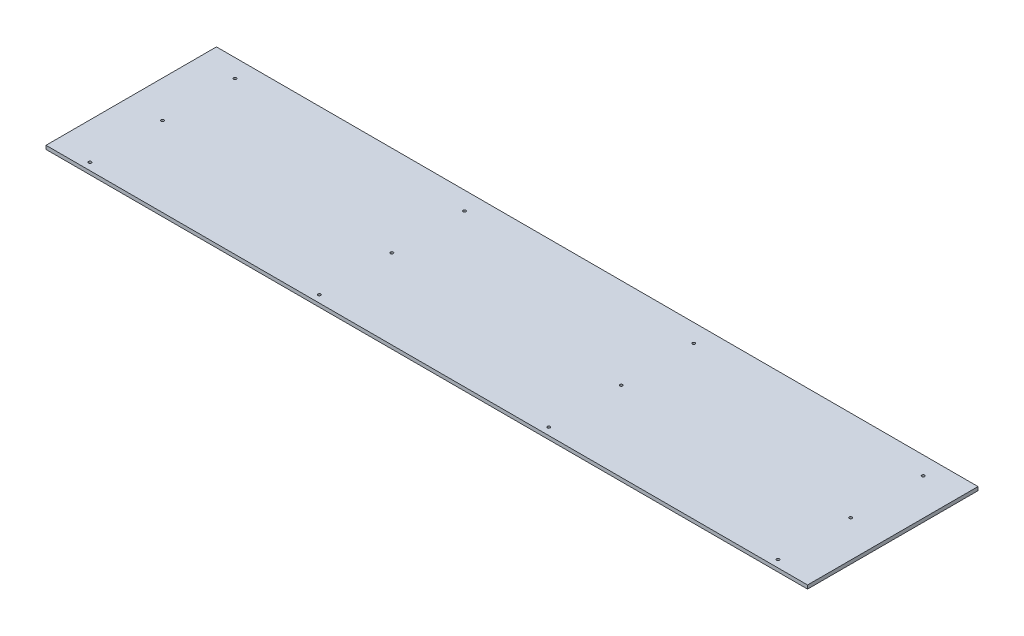
ISO-10303-21;
HEADER;
FILE_DESCRIPTION(('STEP AP214'),'2;1');
FILE_NAME('part.step','',(''),(''),'','','');
FILE_SCHEMA(('AUTOMOTIVE_DESIGN { 1 0 10303 214 1 1 1 1 }'));
ENDSEC;
DATA;
#1=APPLICATION_CONTEXT('core data for automotive mechanical design processes');
#2=APPLICATION_PROTOCOL_DEFINITION('international standard','automotive_design',2000,#1);
#3=PRODUCT_CONTEXT('',#1,'mechanical');
#4=PRODUCT('Part','Part','',(#3));
#5=PRODUCT_RELATED_PRODUCT_CATEGORY('part','',(#4));
#6=PRODUCT_DEFINITION_FORMATION('','',#4);
#7=PRODUCT_DEFINITION_CONTEXT('part definition',#1,'design');
#8=PRODUCT_DEFINITION('design','',#6,#7);
#9=PRODUCT_DEFINITION_SHAPE('','',#8);
#10=(LENGTH_UNIT() NAMED_UNIT(*) SI_UNIT(.MILLI.,.METRE.));
#11=(NAMED_UNIT(*) PLANE_ANGLE_UNIT() SI_UNIT($,.RADIAN.));
#12=(NAMED_UNIT(*) SI_UNIT($,.STERADIAN.) SOLID_ANGLE_UNIT());
#13=UNCERTAINTY_MEASURE_WITH_UNIT(LENGTH_MEASURE(1.E-05),#10,'distance_accuracy_value','');
#14=(GEOMETRIC_REPRESENTATION_CONTEXT(3) GLOBAL_UNCERTAINTY_ASSIGNED_CONTEXT((#13)) GLOBAL_UNIT_ASSIGNED_CONTEXT((#10,
#11,#12)) REPRESENTATION_CONTEXT('',''));
#15=CARTESIAN_POINT('',(0.,0.,0.));
#16=DIRECTION('',(0.,0.,1.));
#17=DIRECTION('',(1.,0.,0.));
#18=AXIS2_PLACEMENT_3D('',#15,#16,#17);
#19=CARTESIAN_POINT('',(0.,6.35,0.));
#20=DIRECTION('',(0.,1.,0.));
#21=DIRECTION('',(0.,0.,1.));
#22=AXIS2_PLACEMENT_3D('',#19,#20,#21);
#23=PLANE('',#22);
#24=CARTESIAN_POINT('',(602.45625,6.35,-120.65));
#25=DIRECTION('',(0.,-1.,0.));
#26=DIRECTION('',(0.,0.,-1.));
#27=AXIS2_PLACEMENT_3D('',#24,#25,#26);
#28=CIRCLE('',#27,2.4384);
#29=CARTESIAN_POINT('',(602.45625,6.35,-123.0884));
#30=VERTEX_POINT('',#29);
#31=EDGE_CURVE('E116',#30,#30,#28,.T.);
#32=ORIENTED_EDGE('',*,*,#31,.T.);
#33=EDGE_LOOP('',(#32));
#34=FACE_BOUND('',#33,.T.);
#35=CARTESIAN_POINT('',(602.45625,6.35,6.35));
#36=DIRECTION('',(0.,-1.,0.));
#37=DIRECTION('',(0.,0.,-1.));
#38=AXIS2_PLACEMENT_3D('',#35,#36,#37);
#39=CIRCLE('',#38,2.4384);
#40=CARTESIAN_POINT('',(602.45625,6.35,3.9116));
#41=VERTEX_POINT('',#40);
#42=EDGE_CURVE('E119',#41,#41,#39,.T.);
#43=ORIENTED_EDGE('',*,*,#42,.T.);
#44=EDGE_LOOP('',(#43));
#45=FACE_BOUND('',#44,.T.);
#46=CARTESIAN_POINT('',(602.45625,6.35,133.35));
#47=DIRECTION('',(0.,-1.,0.));
#48=DIRECTION('',(0.,0.,-1.));
#49=AXIS2_PLACEMENT_3D('',#46,#47,#48);
#50=CIRCLE('',#49,2.4384);
#51=CARTESIAN_POINT('',(602.45625,6.35,130.9116));
#52=VERTEX_POINT('',#51);
#53=EDGE_CURVE('E122',#52,#52,#50,.T.);
#54=ORIENTED_EDGE('',*,*,#53,.T.);
#55=EDGE_LOOP('',(#54));
#56=FACE_BOUND('',#55,.T.);
#57=CARTESIAN_POINT('',(200.81875,6.35,-120.65));
#58=DIRECTION('',(0.,-1.,0.));
#59=DIRECTION('',(0.,0.,-1.));
#60=AXIS2_PLACEMENT_3D('',#57,#58,#59);
#61=CIRCLE('',#60,2.4384);
#62=CARTESIAN_POINT('',(200.81875,6.35,-123.0884));
#63=VERTEX_POINT('',#62);
#64=EDGE_CURVE('E125',#63,#63,#61,.T.);
#65=ORIENTED_EDGE('',*,*,#64,.T.);
#66=EDGE_LOOP('',(#65));
#67=FACE_BOUND('',#66,.T.);
#68=CARTESIAN_POINT('',(200.81875,6.35,6.35));
#69=DIRECTION('',(0.,-1.,0.));
#70=DIRECTION('',(0.,0.,-1.));
#71=AXIS2_PLACEMENT_3D('',#68,#69,#70);
#72=CIRCLE('',#71,2.4384);
#73=CARTESIAN_POINT('',(200.81875,6.35,3.9116));
#74=VERTEX_POINT('',#73);
#75=EDGE_CURVE('E128',#74,#74,#72,.T.);
#76=ORIENTED_EDGE('',*,*,#75,.T.);
#77=EDGE_LOOP('',(#76));
#78=FACE_BOUND('',#77,.T.);
#79=CARTESIAN_POINT('',(200.81875,6.35,133.35));
#80=DIRECTION('',(0.,-1.,0.));
#81=DIRECTION('',(0.,0.,-1.));
#82=AXIS2_PLACEMENT_3D('',#79,#80,#81);
#83=CIRCLE('',#82,2.4384);
#84=CARTESIAN_POINT('',(200.81875,6.35,130.9116));
#85=VERTEX_POINT('',#84);
#86=EDGE_CURVE('E131',#85,#85,#83,.T.);
#87=ORIENTED_EDGE('',*,*,#86,.T.);
#88=EDGE_LOOP('',(#87));
#89=FACE_BOUND('',#88,.T.);
#90=CARTESIAN_POINT('',(-200.81875,6.35,-120.65));
#91=DIRECTION('',(0.,-1.,0.));
#92=DIRECTION('',(0.,0.,-1.));
#93=AXIS2_PLACEMENT_3D('',#90,#91,#92);
#94=CIRCLE('',#93,2.4384);
#95=CARTESIAN_POINT('',(-200.81875,6.35,-123.0884));
#96=VERTEX_POINT('',#95);
#97=EDGE_CURVE('E134',#96,#96,#94,.T.);
#98=ORIENTED_EDGE('',*,*,#97,.T.);
#99=EDGE_LOOP('',(#98));
#100=FACE_BOUND('',#99,.T.);
#101=CARTESIAN_POINT('',(-200.81875,6.35,6.35));
#102=DIRECTION('',(0.,-1.,0.));
#103=DIRECTION('',(0.,0.,-1.));
#104=AXIS2_PLACEMENT_3D('',#101,#102,#103);
#105=CIRCLE('',#104,2.4384);
#106=CARTESIAN_POINT('',(-200.81875,6.35,3.9116));
#107=VERTEX_POINT('',#106);
#108=EDGE_CURVE('E137',#107,#107,#105,.T.);
#109=ORIENTED_EDGE('',*,*,#108,.T.);
#110=EDGE_LOOP('',(#109));
#111=FACE_BOUND('',#110,.T.);
#112=CARTESIAN_POINT('',(-200.81875,6.35,133.35));
#113=DIRECTION('',(0.,-1.,0.));
#114=DIRECTION('',(0.,0.,-1.));
#115=AXIS2_PLACEMENT_3D('',#112,#113,#114);
#116=CIRCLE('',#115,2.4384);
#117=CARTESIAN_POINT('',(-200.81875,6.35,130.9116));
#118=VERTEX_POINT('',#117);
#119=EDGE_CURVE('E140',#118,#118,#116,.T.);
#120=ORIENTED_EDGE('',*,*,#119,.T.);
#121=EDGE_LOOP('',(#120));
#122=FACE_BOUND('',#121,.T.);
#123=CARTESIAN_POINT('',(-602.45625,6.35,-120.65));
#124=DIRECTION('',(0.,-1.,0.));
#125=DIRECTION('',(0.,0.,-1.));
#126=AXIS2_PLACEMENT_3D('',#123,#124,#125);
#127=CIRCLE('',#126,2.4384);
#128=CARTESIAN_POINT('',(-602.45625,6.35,-123.0884));
#129=VERTEX_POINT('',#128);
#130=EDGE_CURVE('E143',#129,#129,#127,.T.);
#131=ORIENTED_EDGE('',*,*,#130,.T.);
#132=EDGE_LOOP('',(#131));
#133=FACE_BOUND('',#132,.T.);
#134=CARTESIAN_POINT('',(-602.45625,6.35,6.35));
#135=DIRECTION('',(0.,-1.,0.));
#136=DIRECTION('',(0.,0.,-1.));
#137=AXIS2_PLACEMENT_3D('',#134,#135,#136);
#138=CIRCLE('',#137,2.4384);
#139=CARTESIAN_POINT('',(-602.45625,6.35,3.9116));
#140=VERTEX_POINT('',#139);
#141=EDGE_CURVE('E145',#140,#140,#138,.T.);
#142=ORIENTED_EDGE('',*,*,#141,.T.);
#143=EDGE_LOOP('',(#142));
#144=FACE_BOUND('',#143,.T.);
#145=CARTESIAN_POINT('',(-602.45625,6.35,133.35));
#146=DIRECTION('',(0.,-1.,0.));
#147=DIRECTION('',(0.,0.,-1.));
#148=AXIS2_PLACEMENT_3D('',#145,#146,#147);
#149=CIRCLE('',#148,2.4384);
#150=CARTESIAN_POINT('',(-602.45625,6.35,130.9116));
#151=VERTEX_POINT('',#150);
#152=EDGE_CURVE('E20',#151,#151,#149,.T.);
#153=ORIENTED_EDGE('',*,*,#152,.T.);
#154=EDGE_LOOP('',(#153));
#155=FACE_BOUND('',#154,.T.);
#156=DIRECTION('',(-1.,0.,0.));
#157=VECTOR('',#156,1.);
#158=CARTESIAN_POINT('',(666.75,6.35,-152.4));
#159=LINE('',#158,#157);
#160=CARTESIAN_POINT('',(-666.75,6.35,-152.4));
#161=VERTEX_POINT('',#160);
#162=CARTESIAN_POINT('',(666.75,6.35,-152.4));
#163=VERTEX_POINT('',#162);
#164=EDGE_CURVE('E71',#161,#163,#159,.F.);
#165=ORIENTED_EDGE('',*,*,#164,.F.);
#166=DIRECTION('',(0.,0.,1.));
#167=VECTOR('',#166,1.);
#168=CARTESIAN_POINT('',(-666.75,6.35,-152.4));
#169=LINE('',#168,#167);
#170=CARTESIAN_POINT('',(-666.75,6.35,146.05));
#171=VERTEX_POINT('',#170);
#172=EDGE_CURVE('E68',#171,#161,#169,.F.);
#173=ORIENTED_EDGE('',*,*,#172,.F.);
#174=DIRECTION('',(1.,0.,0.));
#175=VECTOR('',#174,1.);
#176=CARTESIAN_POINT('',(-666.75,6.35,146.05));
#177=LINE('',#176,#175);
#178=CARTESIAN_POINT('',(666.75,6.35,146.05));
#179=VERTEX_POINT('',#178);
#180=EDGE_CURVE('E59',#179,#171,#177,.F.);
#181=ORIENTED_EDGE('',*,*,#180,.F.);
#182=DIRECTION('',(0.,0.,-1.));
#183=VECTOR('',#182,1.);
#184=CARTESIAN_POINT('',(666.75,6.35,146.05));
#185=LINE('',#184,#183);
#186=EDGE_CURVE('E54',#163,#179,#185,.F.);
#187=ORIENTED_EDGE('',*,*,#186,.F.);
#188=EDGE_LOOP('',(#165,#173,#181,#187));
#189=FACE_BOUND('',#188,.T.);
#190=ADVANCED_FACE('F17',(#34,#45,#56,#67,#78,#89,#100,#111,#122,#133,#144,#155,#189),#23,.T.);
#191=CARTESIAN_POINT('',(-666.75,0.,-152.4));
#192=DIRECTION('',(-1.,0.,0.));
#193=DIRECTION('',(0.,0.,1.));
#194=AXIS2_PLACEMENT_3D('',#191,#192,#193);
#195=PLANE('',#194);
#196=DIRECTION('',(0.,1.,0.));
#197=VECTOR('',#196,1.);
#198=CARTESIAN_POINT('',(-666.75,0.,-152.4));
#199=LINE('',#198,#197);
#200=CARTESIAN_POINT('',(-666.75,0.,-152.4));
#201=VERTEX_POINT('',#200);
#202=EDGE_CURVE('E153',#201,#161,#199,.T.);
#203=ORIENTED_EDGE('',*,*,#202,.F.);
#204=DIRECTION('',(0.,0.,1.));
#205=VECTOR('',#204,1.);
#206=CARTESIAN_POINT('',(-666.75,0.,0.));
#207=LINE('',#206,#205);
#208=CARTESIAN_POINT('',(-666.75,0.,146.05));
#209=VERTEX_POINT('',#208);
#210=EDGE_CURVE('E78',#201,#209,#207,.T.);
#211=ORIENTED_EDGE('',*,*,#210,.T.);
#212=DIRECTION('',(0.,1.,0.));
#213=VECTOR('',#212,1.);
#214=CARTESIAN_POINT('',(-666.75,0.,146.05));
#215=LINE('',#214,#213);
#216=EDGE_CURVE('E64',#171,#209,#215,.F.);
#217=ORIENTED_EDGE('',*,*,#216,.F.);
#218=ORIENTED_EDGE('',*,*,#172,.T.);
#219=EDGE_LOOP('',(#203,#211,#217,#218));
#220=FACE_BOUND('',#219,.T.);
#221=ADVANCED_FACE('F77',(#220),#195,.T.);
#222=CARTESIAN_POINT('',(-666.75,0.,146.05));
#223=DIRECTION('',(0.,0.,1.));
#224=DIRECTION('',(1.,0.,0.));
#225=AXIS2_PLACEMENT_3D('',#222,#223,#224);
#226=PLANE('',#225);
#227=ORIENTED_EDGE('',*,*,#216,.T.);
#228=DIRECTION('',(1.,0.,0.));
#229=VECTOR('',#228,1.);
#230=CARTESIAN_POINT('',(0.,0.,146.05));
#231=LINE('',#230,#229);
#232=CARTESIAN_POINT('',(666.75,0.,146.05));
#233=VERTEX_POINT('',#232);
#234=EDGE_CURVE('E164',#209,#233,#231,.T.);
#235=ORIENTED_EDGE('',*,*,#234,.T.);
#236=DIRECTION('',(0.,1.,0.));
#237=VECTOR('',#236,1.);
#238=CARTESIAN_POINT('',(666.75,0.,146.05));
#239=LINE('',#238,#237);
#240=EDGE_CURVE('E66',#179,#233,#239,.F.);
#241=ORIENTED_EDGE('',*,*,#240,.F.);
#242=ORIENTED_EDGE('',*,*,#180,.T.);
#243=EDGE_LOOP('',(#227,#235,#241,#242));
#244=FACE_BOUND('',#243,.T.);
#245=ADVANCED_FACE('F61',(#244),#226,.T.);
#246=CARTESIAN_POINT('',(666.75,0.,146.05));
#247=DIRECTION('',(1.,0.,0.));
#248=DIRECTION('',(0.,0.,-1.));
#249=AXIS2_PLACEMENT_3D('',#246,#247,#248);
#250=PLANE('',#249);
#251=ORIENTED_EDGE('',*,*,#240,.T.);
#252=DIRECTION('',(0.,0.,1.));
#253=VECTOR('',#252,1.);
#254=CARTESIAN_POINT('',(666.75,0.,0.));
#255=LINE('',#254,#253);
#256=CARTESIAN_POINT('',(666.75,0.,-152.4));
#257=VERTEX_POINT('',#256);
#258=EDGE_CURVE('E161',#233,#257,#255,.F.);
#259=ORIENTED_EDGE('',*,*,#258,.T.);
#260=DIRECTION('',(0.,1.,0.));
#261=VECTOR('',#260,1.);
#262=CARTESIAN_POINT('',(666.75,0.,-152.4));
#263=LINE('',#262,#261);
#264=EDGE_CURVE('E35',#163,#257,#263,.F.);
#265=ORIENTED_EDGE('',*,*,#264,.F.);
#266=ORIENTED_EDGE('',*,*,#186,.T.);
#267=EDGE_LOOP('',(#251,#259,#265,#266));
#268=FACE_BOUND('',#267,.T.);
#269=ADVANCED_FACE('F160',(#268),#250,.T.);
#270=CARTESIAN_POINT('',(666.75,0.,-152.4));
#271=DIRECTION('',(0.,0.,-1.));
#272=DIRECTION('',(-1.,0.,0.));
#273=AXIS2_PLACEMENT_3D('',#270,#271,#272);
#274=PLANE('',#273);
#275=ORIENTED_EDGE('',*,*,#264,.T.);
#276=DIRECTION('',(1.,0.,0.));
#277=VECTOR('',#276,1.);
#278=CARTESIAN_POINT('',(0.,0.,-152.4));
#279=LINE('',#278,#277);
#280=EDGE_CURVE('E115',#257,#201,#279,.F.);
#281=ORIENTED_EDGE('',*,*,#280,.T.);
#282=ORIENTED_EDGE('',*,*,#202,.T.);
#283=ORIENTED_EDGE('',*,*,#164,.T.);
#284=EDGE_LOOP('',(#275,#281,#282,#283));
#285=FACE_BOUND('',#284,.T.);
#286=ADVANCED_FACE('F167',(#285),#274,.T.);
#287=CARTESIAN_POINT('',(-602.45625,6.35,133.35));
#288=DIRECTION('',(0.,-1.,0.));
#289=DIRECTION('',(0.,0.,-1.));
#290=AXIS2_PLACEMENT_3D('',#287,#288,#289);
#291=CYLINDRICAL_SURFACE('',#290,2.4384);
#292=ORIENTED_EDGE('',*,*,#152,.F.);
#293=EDGE_LOOP('',(#292));
#294=FACE_BOUND('',#293,.T.);
#295=CARTESIAN_POINT('',(-602.45625,0.,133.35));
#296=DIRECTION('',(0.,-1.,0.));
#297=DIRECTION('',(0.,0.,-1.));
#298=AXIS2_PLACEMENT_3D('',#295,#296,#297);
#299=CIRCLE('',#298,2.4384);
#300=CARTESIAN_POINT('',(-602.45625,0.,130.9116));
#301=VERTEX_POINT('',#300);
#302=EDGE_CURVE('E112',#301,#301,#299,.T.);
#303=ORIENTED_EDGE('',*,*,#302,.T.);
#304=EDGE_LOOP('',(#303));
#305=FACE_BOUND('',#304,.T.);
#306=ADVANCED_FACE('F169',(#294,#305),#291,.F.);
#307=CARTESIAN_POINT('',(-602.45625,6.35,6.35));
#308=DIRECTION('',(0.,-1.,0.));
#309=DIRECTION('',(0.,0.,-1.));
#310=AXIS2_PLACEMENT_3D('',#307,#308,#309);
#311=CYLINDRICAL_SURFACE('',#310,2.4384);
#312=ORIENTED_EDGE('',*,*,#141,.F.);
#313=EDGE_LOOP('',(#312));
#314=FACE_BOUND('',#313,.T.);
#315=CARTESIAN_POINT('',(-602.45625,0.,6.35));
#316=DIRECTION('',(0.,-1.,0.));
#317=DIRECTION('',(0.,0.,-1.));
#318=AXIS2_PLACEMENT_3D('',#315,#316,#317);
#319=CIRCLE('',#318,2.4384);
#320=CARTESIAN_POINT('',(-602.45625,0.,3.9116));
#321=VERTEX_POINT('',#320);
#322=EDGE_CURVE('E109',#321,#321,#319,.T.);
#323=ORIENTED_EDGE('',*,*,#322,.T.);
#324=EDGE_LOOP('',(#323));
#325=FACE_BOUND('',#324,.T.);
#326=ADVANCED_FACE('F176',(#314,#325),#311,.F.);
#327=CARTESIAN_POINT('',(-602.45625,6.35,-120.65));
#328=DIRECTION('',(0.,-1.,0.));
#329=DIRECTION('',(0.,0.,-1.));
#330=AXIS2_PLACEMENT_3D('',#327,#328,#329);
#331=CYLINDRICAL_SURFACE('',#330,2.4384);
#332=ORIENTED_EDGE('',*,*,#130,.F.);
#333=EDGE_LOOP('',(#332));
#334=FACE_BOUND('',#333,.T.);
#335=CARTESIAN_POINT('',(-602.45625,0.,-120.65));
#336=DIRECTION('',(0.,-1.,0.));
#337=DIRECTION('',(0.,0.,-1.));
#338=AXIS2_PLACEMENT_3D('',#335,#336,#337);
#339=CIRCLE('',#338,2.4384);
#340=CARTESIAN_POINT('',(-602.45625,0.,-123.0884));
#341=VERTEX_POINT('',#340);
#342=EDGE_CURVE('E106',#341,#341,#339,.T.);
#343=ORIENTED_EDGE('',*,*,#342,.T.);
#344=EDGE_LOOP('',(#343));
#345=FACE_BOUND('',#344,.T.);
#346=ADVANCED_FACE('F223',(#334,#345),#331,.F.);
#347=CARTESIAN_POINT('',(-200.81875,6.35,133.35));
#348=DIRECTION('',(0.,-1.,0.));
#349=DIRECTION('',(0.,0.,-1.));
#350=AXIS2_PLACEMENT_3D('',#347,#348,#349);
#351=CYLINDRICAL_SURFACE('',#350,2.4384);
#352=ORIENTED_EDGE('',*,*,#119,.F.);
#353=EDGE_LOOP('',(#352));
#354=FACE_BOUND('',#353,.T.);
#355=CARTESIAN_POINT('',(-200.81875,0.,133.35));
#356=DIRECTION('',(0.,-1.,0.));
#357=DIRECTION('',(0.,0.,-1.));
#358=AXIS2_PLACEMENT_3D('',#355,#356,#357);
#359=CIRCLE('',#358,2.4384);
#360=CARTESIAN_POINT('',(-200.81875,0.,130.9116));
#361=VERTEX_POINT('',#360);
#362=EDGE_CURVE('E103',#361,#361,#359,.T.);
#363=ORIENTED_EDGE('',*,*,#362,.T.);
#364=EDGE_LOOP('',(#363));
#365=FACE_BOUND('',#364,.T.);
#366=ADVANCED_FACE('F219',(#354,#365),#351,.F.);
#367=CARTESIAN_POINT('',(-200.81875,6.35,6.35));
#368=DIRECTION('',(0.,-1.,0.));
#369=DIRECTION('',(0.,0.,-1.));
#370=AXIS2_PLACEMENT_3D('',#367,#368,#369);
#371=CYLINDRICAL_SURFACE('',#370,2.4384);
#372=ORIENTED_EDGE('',*,*,#108,.F.);
#373=EDGE_LOOP('',(#372));
#374=FACE_BOUND('',#373,.T.);
#375=CARTESIAN_POINT('',(-200.81875,0.,6.35));
#376=DIRECTION('',(0.,-1.,0.));
#377=DIRECTION('',(0.,0.,-1.));
#378=AXIS2_PLACEMENT_3D('',#375,#376,#377);
#379=CIRCLE('',#378,2.4384);
#380=CARTESIAN_POINT('',(-200.81875,0.,3.9116));
#381=VERTEX_POINT('',#380);
#382=EDGE_CURVE('E100',#381,#381,#379,.T.);
#383=ORIENTED_EDGE('',*,*,#382,.T.);
#384=EDGE_LOOP('',(#383));
#385=FACE_BOUND('',#384,.T.);
#386=ADVANCED_FACE('F215',(#374,#385),#371,.F.);
#387=CARTESIAN_POINT('',(-200.81875,6.35,-120.65));
#388=DIRECTION('',(0.,-1.,0.));
#389=DIRECTION('',(0.,0.,-1.));
#390=AXIS2_PLACEMENT_3D('',#387,#388,#389);
#391=CYLINDRICAL_SURFACE('',#390,2.4384);
#392=ORIENTED_EDGE('',*,*,#97,.F.);
#393=EDGE_LOOP('',(#392));
#394=FACE_BOUND('',#393,.T.);
#395=CARTESIAN_POINT('',(-200.81875,0.,-120.65));
#396=DIRECTION('',(0.,-1.,0.));
#397=DIRECTION('',(0.,0.,-1.));
#398=AXIS2_PLACEMENT_3D('',#395,#396,#397);
#399=CIRCLE('',#398,2.4384);
#400=CARTESIAN_POINT('',(-200.81875,0.,-123.0884));
#401=VERTEX_POINT('',#400);
#402=EDGE_CURVE('E97',#401,#401,#399,.T.);
#403=ORIENTED_EDGE('',*,*,#402,.T.);
#404=EDGE_LOOP('',(#403));
#405=FACE_BOUND('',#404,.T.);
#406=ADVANCED_FACE('F211',(#394,#405),#391,.F.);
#407=CARTESIAN_POINT('',(200.81875,6.35,133.35));
#408=DIRECTION('',(0.,-1.,0.));
#409=DIRECTION('',(0.,0.,-1.));
#410=AXIS2_PLACEMENT_3D('',#407,#408,#409);
#411=CYLINDRICAL_SURFACE('',#410,2.4384);
#412=ORIENTED_EDGE('',*,*,#86,.F.);
#413=EDGE_LOOP('',(#412));
#414=FACE_BOUND('',#413,.T.);
#415=CARTESIAN_POINT('',(200.81875,0.,133.35));
#416=DIRECTION('',(0.,-1.,0.));
#417=DIRECTION('',(0.,0.,-1.));
#418=AXIS2_PLACEMENT_3D('',#415,#416,#417);
#419=CIRCLE('',#418,2.4384);
#420=CARTESIAN_POINT('',(200.81875,0.,130.9116));
#421=VERTEX_POINT('',#420);
#422=EDGE_CURVE('E94',#421,#421,#419,.T.);
#423=ORIENTED_EDGE('',*,*,#422,.T.);
#424=EDGE_LOOP('',(#423));
#425=FACE_BOUND('',#424,.T.);
#426=ADVANCED_FACE('F207',(#414,#425),#411,.F.);
#427=CARTESIAN_POINT('',(200.81875,6.35,6.35));
#428=DIRECTION('',(0.,-1.,0.));
#429=DIRECTION('',(0.,0.,-1.));
#430=AXIS2_PLACEMENT_3D('',#427,#428,#429);
#431=CYLINDRICAL_SURFACE('',#430,2.4384);
#432=ORIENTED_EDGE('',*,*,#75,.F.);
#433=EDGE_LOOP('',(#432));
#434=FACE_BOUND('',#433,.T.);
#435=CARTESIAN_POINT('',(200.81875,0.,6.35));
#436=DIRECTION('',(0.,-1.,0.));
#437=DIRECTION('',(0.,0.,-1.));
#438=AXIS2_PLACEMENT_3D('',#435,#436,#437);
#439=CIRCLE('',#438,2.4384);
#440=CARTESIAN_POINT('',(200.81875,0.,3.9116));
#441=VERTEX_POINT('',#440);
#442=EDGE_CURVE('E91',#441,#441,#439,.T.);
#443=ORIENTED_EDGE('',*,*,#442,.T.);
#444=EDGE_LOOP('',(#443));
#445=FACE_BOUND('',#444,.T.);
#446=ADVANCED_FACE('F203',(#434,#445),#431,.F.);
#447=CARTESIAN_POINT('',(200.81875,6.35,-120.65));
#448=DIRECTION('',(0.,-1.,0.));
#449=DIRECTION('',(0.,0.,-1.));
#450=AXIS2_PLACEMENT_3D('',#447,#448,#449);
#451=CYLINDRICAL_SURFACE('',#450,2.4384);
#452=ORIENTED_EDGE('',*,*,#64,.F.);
#453=EDGE_LOOP('',(#452));
#454=FACE_BOUND('',#453,.T.);
#455=CARTESIAN_POINT('',(200.81875,0.,-120.65));
#456=DIRECTION('',(0.,-1.,0.));
#457=DIRECTION('',(0.,0.,-1.));
#458=AXIS2_PLACEMENT_3D('',#455,#456,#457);
#459=CIRCLE('',#458,2.4384);
#460=CARTESIAN_POINT('',(200.81875,0.,-123.0884));
#461=VERTEX_POINT('',#460);
#462=EDGE_CURVE('E88',#461,#461,#459,.T.);
#463=ORIENTED_EDGE('',*,*,#462,.T.);
#464=EDGE_LOOP('',(#463));
#465=FACE_BOUND('',#464,.T.);
#466=ADVANCED_FACE('F199',(#454,#465),#451,.F.);
#467=CARTESIAN_POINT('',(602.45625,6.35,133.35));
#468=DIRECTION('',(0.,-1.,0.));
#469=DIRECTION('',(0.,0.,-1.));
#470=AXIS2_PLACEMENT_3D('',#467,#468,#469);
#471=CYLINDRICAL_SURFACE('',#470,2.4384);
#472=ORIENTED_EDGE('',*,*,#53,.F.);
#473=EDGE_LOOP('',(#472));
#474=FACE_BOUND('',#473,.T.);
#475=CARTESIAN_POINT('',(602.45625,0.,133.35));
#476=DIRECTION('',(0.,-1.,0.));
#477=DIRECTION('',(0.,0.,-1.));
#478=AXIS2_PLACEMENT_3D('',#475,#476,#477);
#479=CIRCLE('',#478,2.4384);
#480=CARTESIAN_POINT('',(602.45625,0.,130.9116));
#481=VERTEX_POINT('',#480);
#482=EDGE_CURVE('E85',#481,#481,#479,.T.);
#483=ORIENTED_EDGE('',*,*,#482,.T.);
#484=EDGE_LOOP('',(#483));
#485=FACE_BOUND('',#484,.T.);
#486=ADVANCED_FACE('F195',(#474,#485),#471,.F.);
#487=CARTESIAN_POINT('',(602.45625,6.35,6.35));
#488=DIRECTION('',(0.,-1.,0.));
#489=DIRECTION('',(0.,0.,-1.));
#490=AXIS2_PLACEMENT_3D('',#487,#488,#489);
#491=CYLINDRICAL_SURFACE('',#490,2.4384);
#492=ORIENTED_EDGE('',*,*,#42,.F.);
#493=EDGE_LOOP('',(#492));
#494=FACE_BOUND('',#493,.T.);
#495=CARTESIAN_POINT('',(602.45625,0.,6.35));
#496=DIRECTION('',(0.,-1.,0.));
#497=DIRECTION('',(0.,0.,-1.));
#498=AXIS2_PLACEMENT_3D('',#495,#496,#497);
#499=CIRCLE('',#498,2.4384);
#500=CARTESIAN_POINT('',(602.45625,0.,3.9116));
#501=VERTEX_POINT('',#500);
#502=EDGE_CURVE('E26',#501,#501,#499,.T.);
#503=ORIENTED_EDGE('',*,*,#502,.T.);
#504=EDGE_LOOP('',(#503));
#505=FACE_BOUND('',#504,.T.);
#506=ADVANCED_FACE('F187',(#494,#505),#491,.F.);
#507=CARTESIAN_POINT('',(602.45625,6.35,-120.65));
#508=DIRECTION('',(0.,-1.,0.));
#509=DIRECTION('',(0.,0.,-1.));
#510=AXIS2_PLACEMENT_3D('',#507,#508,#509);
#511=CYLINDRICAL_SURFACE('',#510,2.4384);
#512=ORIENTED_EDGE('',*,*,#31,.F.);
#513=EDGE_LOOP('',(#512));
#514=FACE_BOUND('',#513,.T.);
#515=CARTESIAN_POINT('',(602.45625,0.,-120.65));
#516=DIRECTION('',(0.,-1.,0.));
#517=DIRECTION('',(0.,0.,-1.));
#518=AXIS2_PLACEMENT_3D('',#515,#516,#517);
#519=CIRCLE('',#518,2.4384);
#520=CARTESIAN_POINT('',(602.45625,0.,-123.0884));
#521=VERTEX_POINT('',#520);
#522=EDGE_CURVE('E11',#521,#521,#519,.T.);
#523=ORIENTED_EDGE('',*,*,#522,.T.);
#524=EDGE_LOOP('',(#523));
#525=FACE_BOUND('',#524,.T.);
#526=ADVANCED_FACE('F181',(#514,#525),#511,.F.);
#527=CARTESIAN_POINT('',(0.,0.,0.));
#528=DIRECTION('',(0.,1.,0.));
#529=DIRECTION('',(0.,0.,1.));
#530=AXIS2_PLACEMENT_3D('',#527,#528,#529);
#531=PLANE('',#530);
#532=ORIENTED_EDGE('',*,*,#522,.F.);
#533=EDGE_LOOP('',(#532));
#534=FACE_BOUND('',#533,.T.);
#535=ORIENTED_EDGE('',*,*,#502,.F.);
#536=EDGE_LOOP('',(#535));
#537=FACE_BOUND('',#536,.T.);
#538=ORIENTED_EDGE('',*,*,#482,.F.);
#539=EDGE_LOOP('',(#538));
#540=FACE_BOUND('',#539,.T.);
#541=ORIENTED_EDGE('',*,*,#462,.F.);
#542=EDGE_LOOP('',(#541));
#543=FACE_BOUND('',#542,.T.);
#544=ORIENTED_EDGE('',*,*,#442,.F.);
#545=EDGE_LOOP('',(#544));
#546=FACE_BOUND('',#545,.T.);
#547=ORIENTED_EDGE('',*,*,#422,.F.);
#548=EDGE_LOOP('',(#547));
#549=FACE_BOUND('',#548,.T.);
#550=ORIENTED_EDGE('',*,*,#402,.F.);
#551=EDGE_LOOP('',(#550));
#552=FACE_BOUND('',#551,.T.);
#553=ORIENTED_EDGE('',*,*,#382,.F.);
#554=EDGE_LOOP('',(#553));
#555=FACE_BOUND('',#554,.T.);
#556=ORIENTED_EDGE('',*,*,#362,.F.);
#557=EDGE_LOOP('',(#556));
#558=FACE_BOUND('',#557,.T.);
#559=ORIENTED_EDGE('',*,*,#342,.F.);
#560=EDGE_LOOP('',(#559));
#561=FACE_BOUND('',#560,.T.);
#562=ORIENTED_EDGE('',*,*,#322,.F.);
#563=EDGE_LOOP('',(#562));
#564=FACE_BOUND('',#563,.T.);
#565=ORIENTED_EDGE('',*,*,#302,.F.);
#566=EDGE_LOOP('',(#565));
#567=FACE_BOUND('',#566,.T.);
#568=ORIENTED_EDGE('',*,*,#258,.F.);
#569=ORIENTED_EDGE('',*,*,#234,.F.);
#570=ORIENTED_EDGE('',*,*,#210,.F.);
#571=ORIENTED_EDGE('',*,*,#280,.F.);
#572=EDGE_LOOP('',(#568,#569,#570,#571));
#573=FACE_BOUND('',#572,.T.);
#574=ADVANCED_FACE('F163',(#534,#537,#540,#543,#546,#549,#552,#555,#558,#561,#564,#567,#573),
#531,.F.);
#575=CLOSED_SHELL('',(#190,#221,#245,#269,#286,#306,#326,#346,#366,#386,#406,#426,#446,#466,
#486,#506,#526,#574));
#576=MANIFOLD_SOLID_BREP('B1',#575);
#577=ADVANCED_BREP_SHAPE_REPRESENTATION('',(#18,#576),#14);
#578=SHAPE_DEFINITION_REPRESENTATION(#9,#577);
ENDSEC;
END-ISO-10303-21;
